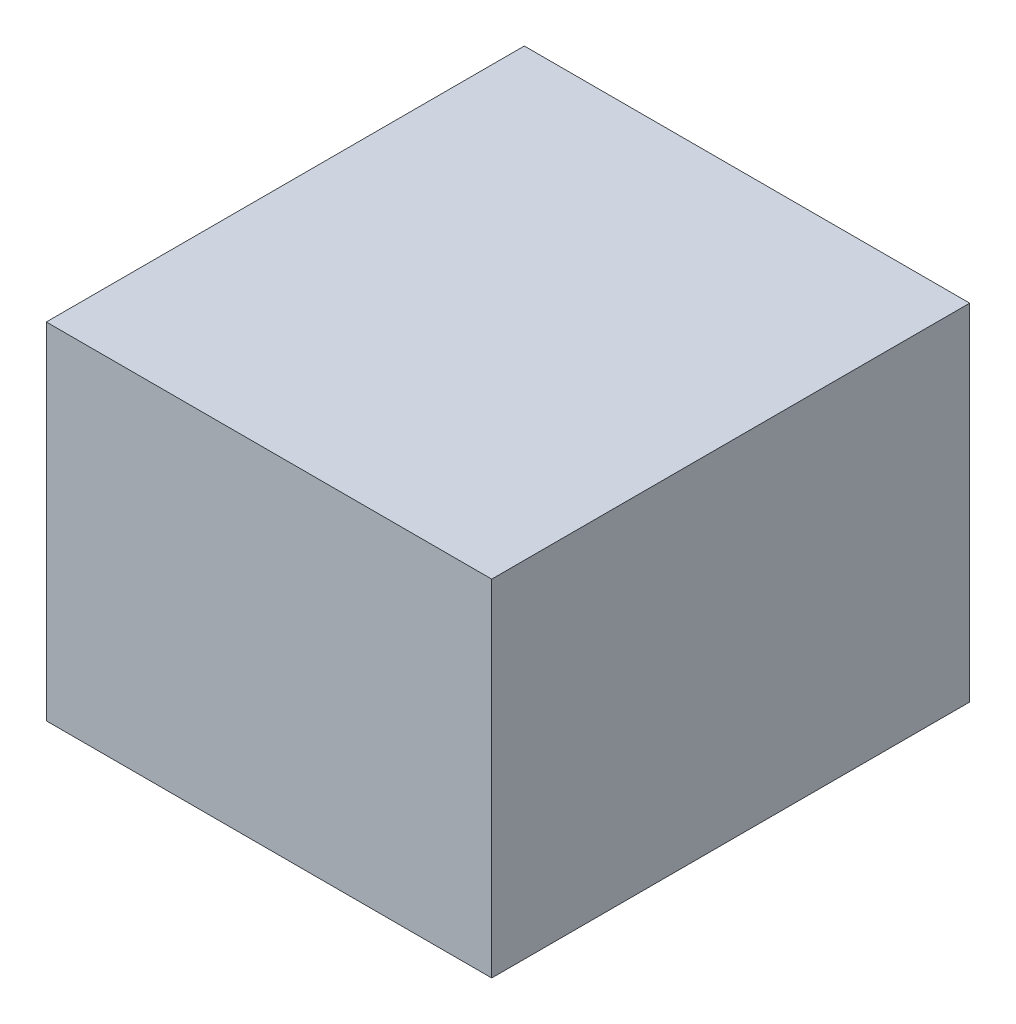
ISO-10303-21;
HEADER;
FILE_DESCRIPTION(('STEP AP214'),'2;1');
FILE_NAME('part.step','',(''),(''),'','','');
FILE_SCHEMA(('AUTOMOTIVE_DESIGN { 1 0 10303 214 1 1 1 1 }'));
ENDSEC;
DATA;
#1=APPLICATION_CONTEXT('core data for automotive mechanical design processes');
#2=APPLICATION_PROTOCOL_DEFINITION('international standard','automotive_design',2000,#1);
#3=PRODUCT_CONTEXT('',#1,'mechanical');
#4=PRODUCT('Part','Part','',(#3));
#5=PRODUCT_RELATED_PRODUCT_CATEGORY('part','',(#4));
#6=PRODUCT_DEFINITION_FORMATION('','',#4);
#7=PRODUCT_DEFINITION_CONTEXT('part definition',#1,'design');
#8=PRODUCT_DEFINITION('design','',#6,#7);
#9=PRODUCT_DEFINITION_SHAPE('','',#8);
#10=(LENGTH_UNIT() NAMED_UNIT(*) SI_UNIT(.MILLI.,.METRE.));
#11=(NAMED_UNIT(*) PLANE_ANGLE_UNIT() SI_UNIT($,.RADIAN.));
#12=(NAMED_UNIT(*) SI_UNIT($,.STERADIAN.) SOLID_ANGLE_UNIT());
#13=UNCERTAINTY_MEASURE_WITH_UNIT(LENGTH_MEASURE(1.E-05),#10,'distance_accuracy_value','');
#14=(GEOMETRIC_REPRESENTATION_CONTEXT(3) GLOBAL_UNCERTAINTY_ASSIGNED_CONTEXT((#13)) GLOBAL_UNIT_ASSIGNED_CONTEXT((#10,
#11,#12)) REPRESENTATION_CONTEXT('',''));
#15=CARTESIAN_POINT('',(0.,0.,0.));
#16=DIRECTION('',(0.,0.,1.));
#17=DIRECTION('',(1.,0.,0.));
#18=AXIS2_PLACEMENT_3D('',#15,#16,#17);
#19=CARTESIAN_POINT('',(2.05000098,-1.58999936,0.));
#20=DIRECTION('',(0.,-1.,0.));
#21=DIRECTION('',(0.,0.,-1.));
#22=AXIS2_PLACEMENT_3D('',#19,#20,#21);
#23=PLANE('',#22);
#24=DIRECTION('',(0.,0.,1.));
#25=VECTOR('',#24,1.);
#26=CARTESIAN_POINT('',(-2.05000098,-1.58999936,0.));
#27=LINE('',#26,#25);
#28=CARTESIAN_POINT('',(-2.05000098,-1.58999936,0.));
#29=VERTEX_POINT('',#28);
#30=CARTESIAN_POINT('',(-2.05000098,-1.58999936,4.39999882));
#31=VERTEX_POINT('',#30);
#32=EDGE_CURVE('E20',#29,#31,#27,.T.);
#33=ORIENTED_EDGE('',*,*,#32,.F.);
#34=DIRECTION('',(1.,0.,0.));
#35=VECTOR('',#34,1.);
#36=CARTESIAN_POINT('',(-2.05000098,-1.58999936,0.));
#37=LINE('',#36,#35);
#38=CARTESIAN_POINT('',(2.05000098,-1.58999936,0.));
#39=VERTEX_POINT('',#38);
#40=EDGE_CURVE('E79',#29,#39,#37,.T.);
#41=ORIENTED_EDGE('',*,*,#40,.T.);
#42=DIRECTION('',(0.,0.,-1.));
#43=VECTOR('',#42,1.);
#44=CARTESIAN_POINT('',(2.05000098,-1.58999936,0.));
#45=LINE('',#44,#43);
#46=CARTESIAN_POINT('',(2.05000098,-1.58999936,4.39999882));
#47=VERTEX_POINT('',#46);
#48=EDGE_CURVE('E61',#47,#39,#45,.T.);
#49=ORIENTED_EDGE('',*,*,#48,.F.);
#50=DIRECTION('',(1.,0.,0.));
#51=VECTOR('',#50,1.);
#52=CARTESIAN_POINT('',(-2.05000098,-1.58999936,4.39999882));
#53=LINE('',#52,#51);
#54=EDGE_CURVE('E56',#31,#47,#53,.T.);
#55=ORIENTED_EDGE('',*,*,#54,.F.);
#56=EDGE_LOOP('',(#33,#41,#49,#55));
#57=FACE_BOUND('',#56,.T.);
#58=ADVANCED_FACE('F17',(#57),#23,.T.);
#59=CARTESIAN_POINT('',(-2.05000098,-1.58999936,0.));
#60=DIRECTION('',(-1.,0.,0.));
#61=DIRECTION('',(0.,0.,1.));
#62=AXIS2_PLACEMENT_3D('',#59,#60,#61);
#63=PLANE('',#62);
#64=DIRECTION('',(0.,0.,1.));
#65=VECTOR('',#64,1.);
#66=CARTESIAN_POINT('',(-2.05000098,1.58999936,0.));
#67=LINE('',#66,#65);
#68=CARTESIAN_POINT('',(-2.05000098,1.58999936,0.));
#69=VERTEX_POINT('',#68);
#70=CARTESIAN_POINT('',(-2.05000098,1.58999936,4.39999882));
#71=VERTEX_POINT('',#70);
#72=EDGE_CURVE('E83',#69,#71,#67,.T.);
#73=ORIENTED_EDGE('',*,*,#72,.F.);
#74=DIRECTION('',(0.,1.,0.));
#75=VECTOR('',#74,1.);
#76=CARTESIAN_POINT('',(-2.05000098,-1.58999936,0.));
#77=LINE('',#76,#75);
#78=EDGE_CURVE('E68',#69,#29,#77,.F.);
#79=ORIENTED_EDGE('',*,*,#78,.T.);
#80=ORIENTED_EDGE('',*,*,#32,.T.);
#81=DIRECTION('',(0.,1.,0.));
#82=VECTOR('',#81,1.);
#83=CARTESIAN_POINT('',(-2.05000098,-1.58999936,4.39999882));
#84=LINE('',#83,#82);
#85=EDGE_CURVE('E63',#71,#31,#84,.F.);
#86=ORIENTED_EDGE('',*,*,#85,.F.);
#87=EDGE_LOOP('',(#73,#79,#80,#86));
#88=FACE_BOUND('',#87,.T.);
#89=ADVANCED_FACE('F65',(#88),#63,.T.);
#90=CARTESIAN_POINT('',(-2.05000098,-1.58999936,4.39999882));
#91=DIRECTION('',(0.,0.,1.));
#92=DIRECTION('',(1.,0.,0.));
#93=AXIS2_PLACEMENT_3D('',#90,#91,#92);
#94=PLANE('',#93);
#95=DIRECTION('',(1.,0.,0.));
#96=VECTOR('',#95,1.);
#97=CARTESIAN_POINT('',(-2.05000098,1.58999936,4.39999882));
#98=LINE('',#97,#96);
#99=CARTESIAN_POINT('',(2.05000098,1.58999936,4.39999882));
#100=VERTEX_POINT('',#99);
#101=EDGE_CURVE('E72',#71,#100,#98,.T.);
#102=ORIENTED_EDGE('',*,*,#101,.F.);
#103=ORIENTED_EDGE('',*,*,#85,.T.);
#104=ORIENTED_EDGE('',*,*,#54,.T.);
#105=DIRECTION('',(0.,1.,0.));
#106=VECTOR('',#105,1.);
#107=CARTESIAN_POINT('',(2.05000098,1.58999936,4.39999882));
#108=LINE('',#107,#106);
#109=EDGE_CURVE('E74',#100,#47,#108,.F.);
#110=ORIENTED_EDGE('',*,*,#109,.F.);
#111=EDGE_LOOP('',(#102,#103,#104,#110));
#112=FACE_BOUND('',#111,.T.);
#113=ADVANCED_FACE('F70',(#112),#94,.T.);
#114=CARTESIAN_POINT('',(2.05000098,1.58999936,0.));
#115=DIRECTION('',(1.,0.,0.));
#116=DIRECTION('',(0.,0.,-1.));
#117=AXIS2_PLACEMENT_3D('',#114,#115,#116);
#118=PLANE('',#117);
#119=ORIENTED_EDGE('',*,*,#48,.T.);
#120=DIRECTION('',(0.,1.,0.));
#121=VECTOR('',#120,1.);
#122=CARTESIAN_POINT('',(2.05000098,-1.58999936,0.));
#123=LINE('',#122,#121);
#124=CARTESIAN_POINT('',(2.05000098,1.58999936,0.));
#125=VERTEX_POINT('',#124);
#126=EDGE_CURVE('E35',#39,#125,#123,.T.);
#127=ORIENTED_EDGE('',*,*,#126,.T.);
#128=DIRECTION('',(0.,0.,1.));
#129=VECTOR('',#128,1.);
#130=CARTESIAN_POINT('',(2.05000098,1.58999936,0.));
#131=LINE('',#130,#129);
#132=EDGE_CURVE('E26',#100,#125,#131,.F.);
#133=ORIENTED_EDGE('',*,*,#132,.F.);
#134=ORIENTED_EDGE('',*,*,#109,.T.);
#135=EDGE_LOOP('',(#119,#127,#133,#134));
#136=FACE_BOUND('',#135,.T.);
#137=ADVANCED_FACE('F89',(#136),#118,.T.);
#138=CARTESIAN_POINT('',(-2.05000098,-1.58999936,0.));
#139=DIRECTION('',(0.,0.,1.));
#140=DIRECTION('',(1.,0.,0.));
#141=AXIS2_PLACEMENT_3D('',#138,#139,#140);
#142=PLANE('',#141);
#143=DIRECTION('',(1.,0.,0.));
#144=VECTOR('',#143,1.);
#145=CARTESIAN_POINT('',(-2.05000098,1.58999936,0.));
#146=LINE('',#145,#144);
#147=EDGE_CURVE('E11',#125,#69,#146,.F.);
#148=ORIENTED_EDGE('',*,*,#147,.F.);
#149=ORIENTED_EDGE('',*,*,#126,.F.);
#150=ORIENTED_EDGE('',*,*,#40,.F.);
#151=ORIENTED_EDGE('',*,*,#78,.F.);
#152=EDGE_LOOP('',(#148,#149,#150,#151));
#153=FACE_BOUND('',#152,.T.);
#154=ADVANCED_FACE('F91',(#153),#142,.F.);
#155=CARTESIAN_POINT('',(-2.05000098,1.58999936,0.));
#156=DIRECTION('',(0.,1.,0.));
#157=DIRECTION('',(0.,0.,1.));
#158=AXIS2_PLACEMENT_3D('',#155,#156,#157);
#159=PLANE('',#158);
#160=ORIENTED_EDGE('',*,*,#132,.T.);
#161=ORIENTED_EDGE('',*,*,#147,.T.);
#162=ORIENTED_EDGE('',*,*,#72,.T.);
#163=ORIENTED_EDGE('',*,*,#101,.T.);
#164=EDGE_LOOP('',(#160,#161,#162,#163));
#165=FACE_BOUND('',#164,.T.);
#166=ADVANCED_FACE('F88',(#165),#159,.T.);
#167=CLOSED_SHELL('',(#58,#89,#113,#137,#154,#166));
#168=MANIFOLD_SOLID_BREP('B1',#167);
#169=ADVANCED_BREP_SHAPE_REPRESENTATION('',(#18,#168),#14);
#170=SHAPE_DEFINITION_REPRESENTATION(#9,#169);
ENDSEC;
END-ISO-10303-21;
